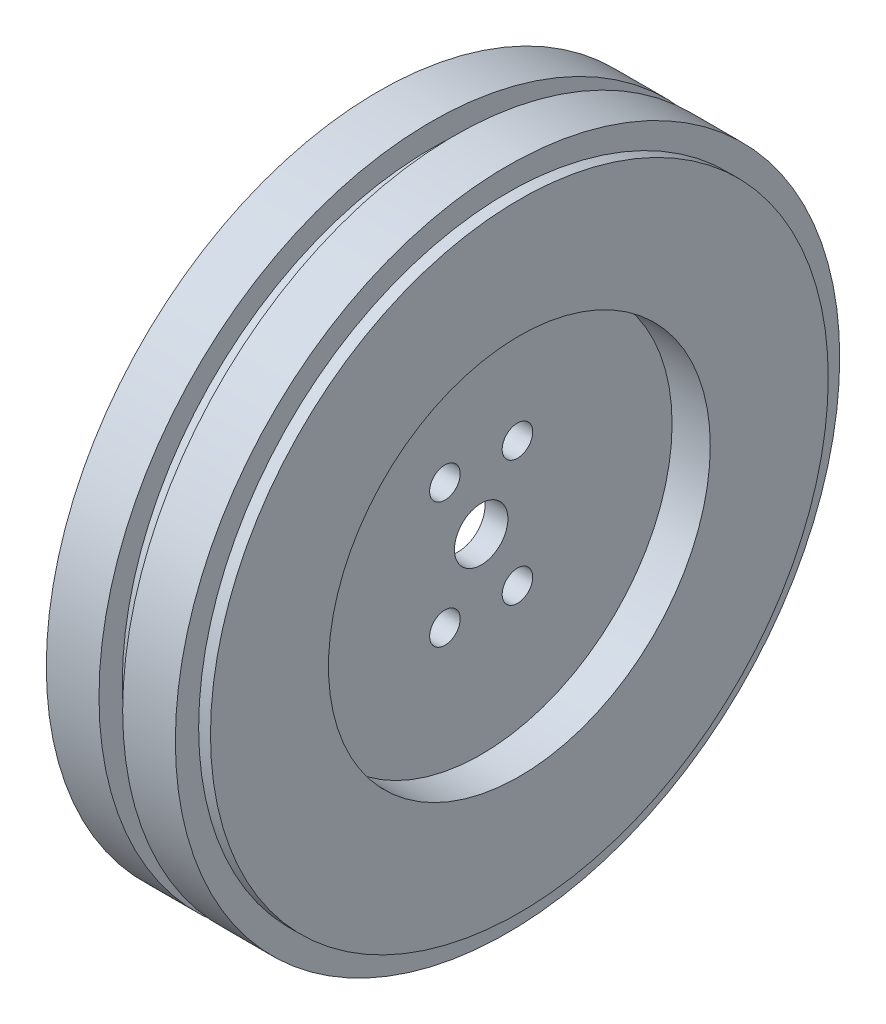
ISO-10303-21;
HEADER;
FILE_DESCRIPTION(('STEP AP214'),'2;1');
FILE_NAME('part.step','',(''),(''),'','','');
FILE_SCHEMA(('AUTOMOTIVE_DESIGN { 1 0 10303 214 1 1 1 1 }'));
ENDSEC;
DATA;
#1=APPLICATION_CONTEXT('core data for automotive mechanical design processes');
#2=APPLICATION_PROTOCOL_DEFINITION('international standard','automotive_design',2000,#1);
#3=PRODUCT_CONTEXT('',#1,'mechanical');
#4=PRODUCT('Part','Part','',(#3));
#5=PRODUCT_RELATED_PRODUCT_CATEGORY('part','',(#4));
#6=PRODUCT_DEFINITION_FORMATION('','',#4);
#7=PRODUCT_DEFINITION_CONTEXT('part definition',#1,'design');
#8=PRODUCT_DEFINITION('design','',#6,#7);
#9=PRODUCT_DEFINITION_SHAPE('','',#8);
#10=(LENGTH_UNIT() NAMED_UNIT(*) SI_UNIT(.MILLI.,.METRE.));
#11=(NAMED_UNIT(*) PLANE_ANGLE_UNIT() SI_UNIT($,.RADIAN.));
#12=(NAMED_UNIT(*) SI_UNIT($,.STERADIAN.) SOLID_ANGLE_UNIT());
#13=UNCERTAINTY_MEASURE_WITH_UNIT(LENGTH_MEASURE(1.E-05),#10,'distance_accuracy_value','');
#14=(GEOMETRIC_REPRESENTATION_CONTEXT(3) GLOBAL_UNCERTAINTY_ASSIGNED_CONTEXT((#13)) GLOBAL_UNIT_ASSIGNED_CONTEXT((#10,
#11,#12)) REPRESENTATION_CONTEXT('',''));
#15=CARTESIAN_POINT('',(0.,0.,0.));
#16=DIRECTION('',(0.,0.,1.));
#17=DIRECTION('',(1.,0.,0.));
#18=AXIS2_PLACEMENT_3D('',#15,#16,#17);
#19=CARTESIAN_POINT('',(8.00000000000001,0.,0.));
#20=DIRECTION('',(-1.,0.,0.));
#21=DIRECTION('',(0.,0.,1.));
#22=AXIS2_PLACEMENT_3D('',#19,#20,#21);
#23=CYLINDRICAL_SURFACE('',#22,43.5);
#24=CARTESIAN_POINT('',(-0.449999999999995,0.,0.));
#25=DIRECTION('',(-1.,0.,0.));
#26=DIRECTION('',(0.,0.,1.));
#27=AXIS2_PLACEMENT_3D('',#24,#25,#26);
#28=CIRCLE('',#27,43.5);
#29=CARTESIAN_POINT('',(-0.449999999999995,0.,43.5));
#30=VERTEX_POINT('',#29);
#31=EDGE_CURVE('E97',#30,#30,#28,.T.);
#32=ORIENTED_EDGE('',*,*,#31,.F.);
#33=EDGE_LOOP('',(#32));
#34=FACE_BOUND('',#33,.T.);
#35=CARTESIAN_POINT('',(6.45,0.,0.));
#36=DIRECTION('',(1.,0.,0.));
#37=DIRECTION('',(0.,0.,-1.));
#38=AXIS2_PLACEMENT_3D('',#35,#36,#37);
#39=CIRCLE('',#38,43.5);
#40=CARTESIAN_POINT('',(6.45,0.,-43.5));
#41=VERTEX_POINT('',#40);
#42=EDGE_CURVE('E103',#41,#41,#39,.T.);
#43=ORIENTED_EDGE('',*,*,#42,.F.);
#44=EDGE_LOOP('',(#43));
#45=FACE_BOUND('',#44,.T.);
#46=ADVANCED_FACE('F32',(#34,#45),#23,.T.);
#47=CARTESIAN_POINT('',(8.,40.,0.));
#48=DIRECTION('',(-1.,0.,0.));
#49=DIRECTION('',(0.,0.,1.));
#50=AXIS2_PLACEMENT_3D('',#47,#48,#49);
#51=PLANE('',#50);
#52=CARTESIAN_POINT('',(8.,0.,0.));
#53=DIRECTION('',(1.,0.,0.));
#54=DIRECTION('',(0.,0.,-1.));
#55=AXIS2_PLACEMENT_3D('',#52,#53,#54);
#56=CIRCLE('',#55,25.);
#57=CARTESIAN_POINT('',(8.,0.,-25.));
#58=VERTEX_POINT('',#57);
#59=EDGE_CURVE('E77',#58,#58,#56,.T.);
#60=ORIENTED_EDGE('',*,*,#59,.F.);
#61=EDGE_LOOP('',(#60));
#62=FACE_BOUND('',#61,.T.);
#63=CARTESIAN_POINT('',(8.,0.,0.));
#64=DIRECTION('',(1.,0.,0.));
#65=DIRECTION('',(0.,0.,-1.));
#66=AXIS2_PLACEMENT_3D('',#63,#64,#65);
#67=CIRCLE('',#66,40.45);
#68=CARTESIAN_POINT('',(8.,0.,-40.45));
#69=VERTEX_POINT('',#68);
#70=EDGE_CURVE('E107',#69,#69,#67,.T.);
#71=ORIENTED_EDGE('',*,*,#70,.T.);
#72=EDGE_LOOP('',(#71));
#73=FACE_BOUND('',#72,.T.);
#74=ADVANCED_FACE('F124',(#62,#73),#51,.F.);
#75=CARTESIAN_POINT('',(-12.,0.,0.));
#76=DIRECTION('',(-1.,0.,0.));
#77=DIRECTION('',(0.,0.,1.));
#78=AXIS2_PLACEMENT_3D('',#75,#76,#77);
#79=PLANE('',#78);
#80=CARTESIAN_POINT('',(-12.,0.,0.));
#81=DIRECTION('',(-1.,0.,0.));
#82=DIRECTION('',(0.,0.,1.));
#83=AXIS2_PLACEMENT_3D('',#80,#81,#82);
#84=CIRCLE('',#83,34.);
#85=CARTESIAN_POINT('',(-12.,0.,34.));
#86=VERTEX_POINT('',#85);
#87=EDGE_CURVE('E73',#86,#86,#84,.F.);
#88=ORIENTED_EDGE('',*,*,#87,.T.);
#89=EDGE_LOOP('',(#88));
#90=FACE_BOUND('',#89,.T.);
#91=CARTESIAN_POINT('',(-12.,0.,0.));
#92=DIRECTION('',(-1.,0.,0.));
#93=DIRECTION('',(0.,0.,1.));
#94=AXIS2_PLACEMENT_3D('',#91,#92,#93);
#95=CIRCLE('',#94,40.45);
#96=CARTESIAN_POINT('',(-12.,0.,40.45));
#97=VERTEX_POINT('',#96);
#98=EDGE_CURVE('E86',#97,#97,#95,.T.);
#99=ORIENTED_EDGE('',*,*,#98,.T.);
#100=EDGE_LOOP('',(#99));
#101=FACE_BOUND('',#100,.T.);
#102=ADVANCED_FACE('F131',(#90,#101),#79,.T.);
#103=CARTESIAN_POINT('',(-3.54999999999999,0.,0.));
#104=DIRECTION('',(-1.,0.,0.));
#105=DIRECTION('',(0.,0.,1.));
#106=AXIS2_PLACEMENT_3D('',#103,#104,#105);
#107=CIRCLE('',#106,43.5);
#108=CARTESIAN_POINT('',(-3.54999999999999,0.,43.5));
#109=VERTEX_POINT('',#108);
#110=EDGE_CURVE('E89',#109,#109,#107,.T.);
#111=ORIENTED_EDGE('',*,*,#110,.T.);
#112=EDGE_LOOP('',(#111));
#113=FACE_BOUND('',#112,.T.);
#114=CARTESIAN_POINT('',(-10.45,0.,0.));
#115=DIRECTION('',(-1.,0.,0.));
#116=DIRECTION('',(0.,0.,1.));
#117=AXIS2_PLACEMENT_3D('',#114,#115,#116);
#118=CIRCLE('',#117,43.5);
#119=CARTESIAN_POINT('',(-10.45,0.,43.5));
#120=VERTEX_POINT('',#119);
#121=EDGE_CURVE('E80',#120,#120,#118,.T.);
#122=ORIENTED_EDGE('',*,*,#121,.F.);
#123=EDGE_LOOP('',(#122));
#124=FACE_BOUND('',#123,.T.);
#125=ADVANCED_FACE('F127',(#113,#124),#23,.T.);
#126=CARTESIAN_POINT('',(-49.6444990272902,0.,0.));
#127=DIRECTION('',(-1.,0.,0.));
#128=DIRECTION('',(0.,0.,1.));
#129=AXIS2_PLACEMENT_3D('',#126,#127,#128);
#130=CYLINDRICAL_SURFACE('',#129,34.);
#131=CARTESIAN_POINT('',(0.,0.,0.));
#132=DIRECTION('',(-1.,0.,0.));
#133=DIRECTION('',(0.,0.,1.));
#134=AXIS2_PLACEMENT_3D('',#131,#132,#133);
#135=CIRCLE('',#134,34.);
#136=CARTESIAN_POINT('',(0.,0.,34.));
#137=VERTEX_POINT('',#136);
#138=EDGE_CURVE('E10',#137,#137,#135,.T.);
#139=ORIENTED_EDGE('',*,*,#138,.F.);
#140=EDGE_LOOP('',(#139));
#141=FACE_BOUND('',#140,.T.);
#142=ORIENTED_EDGE('',*,*,#87,.F.);
#143=EDGE_LOOP('',(#142));
#144=FACE_BOUND('',#143,.T.);
#145=ADVANCED_FACE('F34',(#141,#144),#130,.F.);
#146=CARTESIAN_POINT('',(0.,34.,0.));
#147=DIRECTION('',(1.,0.,0.));
#148=DIRECTION('',(0.,0.,-1.));
#149=AXIS2_PLACEMENT_3D('',#146,#147,#148);
#150=PLANE('',#149);
#151=CARTESIAN_POINT('',(0.,0.,0.));
#152=DIRECTION('',(1.,0.,0.));
#153=DIRECTION('',(0.,0.,-1.));
#154=AXIS2_PLACEMENT_3D('',#151,#152,#153);
#155=CIRCLE('',#154,3.5);
#156=CARTESIAN_POINT('',(0.,0.,-3.5));
#157=VERTEX_POINT('',#156);
#158=EDGE_CURVE('E67',#157,#157,#155,.T.);
#159=ORIENTED_EDGE('',*,*,#158,.T.);
#160=EDGE_LOOP('',(#159));
#161=FACE_BOUND('',#160,.T.);
#162=CARTESIAN_POINT('',(0.,8.22724133595216,4.75000000000001));
#163=DIRECTION('',(1.,0.,0.));
#164=DIRECTION('',(0.,0.,-1.));
#165=AXIS2_PLACEMENT_3D('',#162,#163,#164);
#166=CIRCLE('',#165,2.);
#167=CARTESIAN_POINT('',(0.,8.22724133595216,2.75000000000001));
#168=VERTEX_POINT('',#167);
#169=EDGE_CURVE('E39',#168,#168,#166,.T.);
#170=ORIENTED_EDGE('',*,*,#169,.T.);
#171=EDGE_LOOP('',(#170));
#172=FACE_BOUND('',#171,.T.);
#173=CARTESIAN_POINT('',(0.,-8.22724133595216,-4.75000000000001));
#174=DIRECTION('',(1.,0.,0.));
#175=DIRECTION('',(0.,0.,-1.));
#176=AXIS2_PLACEMENT_3D('',#173,#174,#175);
#177=CIRCLE('',#176,2.);
#178=CARTESIAN_POINT('',(0.,-8.22724133595216,-6.75000000000001));
#179=VERTEX_POINT('',#178);
#180=EDGE_CURVE('E43',#179,#179,#177,.T.);
#181=ORIENTED_EDGE('',*,*,#180,.T.);
#182=EDGE_LOOP('',(#181));
#183=FACE_BOUND('',#182,.T.);
#184=CARTESIAN_POINT('',(0.,-8.22724133595216,4.75000000000001));
#185=DIRECTION('',(1.,0.,0.));
#186=DIRECTION('',(0.,0.,-1.));
#187=AXIS2_PLACEMENT_3D('',#184,#185,#186);
#188=CIRCLE('',#187,2.);
#189=CARTESIAN_POINT('',(0.,-8.22724133595216,2.75000000000001));
#190=VERTEX_POINT('',#189);
#191=EDGE_CURVE('E47',#190,#190,#188,.T.);
#192=ORIENTED_EDGE('',*,*,#191,.T.);
#193=EDGE_LOOP('',(#192));
#194=FACE_BOUND('',#193,.T.);
#195=CARTESIAN_POINT('',(0.,8.22724133595216,-4.75000000000001));
#196=DIRECTION('',(1.,0.,0.));
#197=DIRECTION('',(0.,0.,-1.));
#198=AXIS2_PLACEMENT_3D('',#195,#196,#197);
#199=CIRCLE('',#198,2.);
#200=CARTESIAN_POINT('',(0.,8.22724133595216,-6.75000000000001));
#201=VERTEX_POINT('',#200);
#202=EDGE_CURVE('E52',#201,#201,#199,.T.);
#203=ORIENTED_EDGE('',*,*,#202,.T.);
#204=EDGE_LOOP('',(#203));
#205=FACE_BOUND('',#204,.T.);
#206=ORIENTED_EDGE('',*,*,#138,.T.);
#207=EDGE_LOOP('',(#206));
#208=FACE_BOUND('',#207,.T.);
#209=ADVANCED_FACE('F142',(#161,#172,#183,#194,#205,#208),#150,.F.);
#210=CARTESIAN_POINT('',(3.,12.5,0.));
#211=DIRECTION('',(1.,0.,0.));
#212=DIRECTION('',(0.,0.,-1.));
#213=AXIS2_PLACEMENT_3D('',#210,#211,#212);
#214=PLANE('',#213);
#215=CARTESIAN_POINT('',(3.,0.,0.));
#216=DIRECTION('',(1.,0.,0.));
#217=DIRECTION('',(0.,0.,-1.));
#218=AXIS2_PLACEMENT_3D('',#215,#216,#217);
#219=CIRCLE('',#218,3.5);
#220=CARTESIAN_POINT('',(3.,0.,-3.5));
#221=VERTEX_POINT('',#220);
#222=EDGE_CURVE('E70',#221,#221,#219,.T.);
#223=ORIENTED_EDGE('',*,*,#222,.F.);
#224=EDGE_LOOP('',(#223));
#225=FACE_BOUND('',#224,.T.);
#226=CARTESIAN_POINT('',(3.,8.22724133595216,4.75000000000001));
#227=DIRECTION('',(1.,0.,0.));
#228=DIRECTION('',(0.,0.,1.));
#229=AXIS2_PLACEMENT_3D('',#226,#227,#228);
#230=CIRCLE('',#229,2.);
#231=CARTESIAN_POINT('',(3.,8.22724133595216,6.75000000000001));
#232=VERTEX_POINT('',#231);
#233=EDGE_CURVE('E58',#232,#232,#230,.T.);
#234=ORIENTED_EDGE('',*,*,#233,.F.);
#235=EDGE_LOOP('',(#234));
#236=FACE_BOUND('',#235,.T.);
#237=CARTESIAN_POINT('',(3.,-8.22724133595216,-4.75000000000001));
#238=DIRECTION('',(1.,0.,0.));
#239=DIRECTION('',(0.,0.,1.));
#240=AXIS2_PLACEMENT_3D('',#237,#238,#239);
#241=CIRCLE('',#240,2.);
#242=CARTESIAN_POINT('',(3.,-8.22724133595216,-2.75000000000001));
#243=VERTEX_POINT('',#242);
#244=EDGE_CURVE('E59',#243,#243,#241,.T.);
#245=ORIENTED_EDGE('',*,*,#244,.F.);
#246=EDGE_LOOP('',(#245));
#247=FACE_BOUND('',#246,.T.);
#248=CARTESIAN_POINT('',(3.,-8.22724133595216,4.75000000000001));
#249=DIRECTION('',(1.,0.,0.));
#250=DIRECTION('',(0.,0.,-1.));
#251=AXIS2_PLACEMENT_3D('',#248,#249,#250);
#252=CIRCLE('',#251,2.);
#253=CARTESIAN_POINT('',(3.,-8.22724133595216,2.75000000000001));
#254=VERTEX_POINT('',#253);
#255=EDGE_CURVE('E62',#254,#254,#252,.T.);
#256=ORIENTED_EDGE('',*,*,#255,.F.);
#257=EDGE_LOOP('',(#256));
#258=FACE_BOUND('',#257,.T.);
#259=CARTESIAN_POINT('',(3.,8.22724133595216,-4.75000000000001));
#260=DIRECTION('',(1.,0.,0.));
#261=DIRECTION('',(0.,0.,-1.));
#262=AXIS2_PLACEMENT_3D('',#259,#260,#261);
#263=CIRCLE('',#262,2.);
#264=CARTESIAN_POINT('',(3.,8.22724133595216,-6.75000000000001));
#265=VERTEX_POINT('',#264);
#266=EDGE_CURVE('E55',#265,#265,#263,.T.);
#267=ORIENTED_EDGE('',*,*,#266,.F.);
#268=EDGE_LOOP('',(#267));
#269=FACE_BOUND('',#268,.T.);
#270=CARTESIAN_POINT('',(3.,0.,0.));
#271=DIRECTION('',(1.,0.,0.));
#272=DIRECTION('',(0.,0.,-1.));
#273=AXIS2_PLACEMENT_3D('',#270,#271,#272);
#274=CIRCLE('',#273,25.);
#275=CARTESIAN_POINT('',(3.,0.,-25.));
#276=VERTEX_POINT('',#275);
#277=EDGE_CURVE('E76',#276,#276,#274,.T.);
#278=ORIENTED_EDGE('',*,*,#277,.T.);
#279=EDGE_LOOP('',(#278));
#280=FACE_BOUND('',#279,.T.);
#281=ADVANCED_FACE('F233',(#225,#236,#247,#258,#269,#280),#214,.T.);
#282=CARTESIAN_POINT('',(-32.,8.22724133595216,-4.75000000000001));
#283=DIRECTION('',(1.,0.,0.));
#284=DIRECTION('',(0.,0.,-1.));
#285=AXIS2_PLACEMENT_3D('',#282,#283,#284);
#286=CYLINDRICAL_SURFACE('',#285,2.);
#287=ORIENTED_EDGE('',*,*,#266,.T.);
#288=EDGE_LOOP('',(#287));
#289=FACE_BOUND('',#288,.T.);
#290=ORIENTED_EDGE('',*,*,#202,.F.);
#291=EDGE_LOOP('',(#290));
#292=FACE_BOUND('',#291,.T.);
#293=ADVANCED_FACE('F237',(#289,#292),#286,.F.);
#294=CARTESIAN_POINT('',(-32.,-8.22724133595216,4.75000000000001));
#295=DIRECTION('',(1.,0.,0.));
#296=DIRECTION('',(0.,0.,-1.));
#297=AXIS2_PLACEMENT_3D('',#294,#295,#296);
#298=CYLINDRICAL_SURFACE('',#297,2.);
#299=ORIENTED_EDGE('',*,*,#255,.T.);
#300=EDGE_LOOP('',(#299));
#301=FACE_BOUND('',#300,.T.);
#302=ORIENTED_EDGE('',*,*,#191,.F.);
#303=EDGE_LOOP('',(#302));
#304=FACE_BOUND('',#303,.T.);
#305=ADVANCED_FACE('F283',(#301,#304),#298,.F.);
#306=CARTESIAN_POINT('',(-32.,-8.22724133595216,-4.75000000000001));
#307=DIRECTION('',(1.,0.,0.));
#308=DIRECTION('',(0.,0.,-1.));
#309=AXIS2_PLACEMENT_3D('',#306,#307,#308);
#310=CYLINDRICAL_SURFACE('',#309,2.);
#311=ORIENTED_EDGE('',*,*,#244,.T.);
#312=EDGE_LOOP('',(#311));
#313=FACE_BOUND('',#312,.T.);
#314=ORIENTED_EDGE('',*,*,#180,.F.);
#315=EDGE_LOOP('',(#314));
#316=FACE_BOUND('',#315,.T.);
#317=ADVANCED_FACE('F273',(#313,#316),#310,.F.);
#318=CARTESIAN_POINT('',(-32.,8.22724133595216,4.75000000000001));
#319=DIRECTION('',(1.,0.,0.));
#320=DIRECTION('',(0.,0.,-1.));
#321=AXIS2_PLACEMENT_3D('',#318,#319,#320);
#322=CYLINDRICAL_SURFACE('',#321,2.);
#323=ORIENTED_EDGE('',*,*,#233,.T.);
#324=EDGE_LOOP('',(#323));
#325=FACE_BOUND('',#324,.T.);
#326=ORIENTED_EDGE('',*,*,#169,.F.);
#327=EDGE_LOOP('',(#326));
#328=FACE_BOUND('',#327,.T.);
#329=ADVANCED_FACE('F255',(#325,#328),#322,.F.);
#330=CARTESIAN_POINT('',(-32.,0.,0.));
#331=DIRECTION('',(1.,0.,0.));
#332=DIRECTION('',(0.,0.,-1.));
#333=AXIS2_PLACEMENT_3D('',#330,#331,#332);
#334=CYLINDRICAL_SURFACE('',#333,3.5);
#335=ORIENTED_EDGE('',*,*,#222,.T.);
#336=EDGE_LOOP('',(#335));
#337=FACE_BOUND('',#336,.T.);
#338=ORIENTED_EDGE('',*,*,#158,.F.);
#339=EDGE_LOOP('',(#338));
#340=FACE_BOUND('',#339,.T.);
#341=ADVANCED_FACE('F162',(#337,#340),#334,.F.);
#342=CARTESIAN_POINT('',(3.,0.,0.));
#343=DIRECTION('',(1.,0.,0.));
#344=DIRECTION('',(0.,0.,-1.));
#345=AXIS2_PLACEMENT_3D('',#342,#343,#344);
#346=CYLINDRICAL_SURFACE('',#345,25.);
#347=ORIENTED_EDGE('',*,*,#277,.F.);
#348=EDGE_LOOP('',(#347));
#349=FACE_BOUND('',#348,.T.);
#350=ORIENTED_EDGE('',*,*,#59,.T.);
#351=EDGE_LOOP('',(#350));
#352=FACE_BOUND('',#351,.T.);
#353=ADVANCED_FACE('F153',(#349,#352),#346,.F.);
#354=CARTESIAN_POINT('',(-10.45,0.,0.));
#355=DIRECTION('',(-1.,0.,0.));
#356=DIRECTION('',(0.,0.,1.));
#357=AXIS2_PLACEMENT_3D('',#354,#355,#356);
#358=PLANE('',#357);
#359=CARTESIAN_POINT('',(-10.45,0.,0.));
#360=DIRECTION('',(-1.,0.,0.));
#361=DIRECTION('',(0.,0.,1.));
#362=AXIS2_PLACEMENT_3D('',#359,#360,#361);
#363=CIRCLE('',#362,40.45);
#364=CARTESIAN_POINT('',(-10.45,0.,40.45));
#365=VERTEX_POINT('',#364);
#366=EDGE_CURVE('E85',#365,#365,#363,.T.);
#367=ORIENTED_EDGE('',*,*,#366,.F.);
#368=EDGE_LOOP('',(#367));
#369=FACE_BOUND('',#368,.T.);
#370=ORIENTED_EDGE('',*,*,#121,.T.);
#371=EDGE_LOOP('',(#370));
#372=FACE_BOUND('',#371,.T.);
#373=ADVANCED_FACE('F150',(#369,#372),#358,.T.);
#374=CARTESIAN_POINT('',(-10.45,0.,0.));
#375=DIRECTION('',(-1.,0.,0.));
#376=DIRECTION('',(0.,0.,1.));
#377=AXIS2_PLACEMENT_3D('',#374,#375,#376);
#378=CYLINDRICAL_SURFACE('',#377,40.45);
#379=ORIENTED_EDGE('',*,*,#366,.T.);
#380=EDGE_LOOP('',(#379));
#381=FACE_BOUND('',#380,.T.);
#382=ORIENTED_EDGE('',*,*,#98,.F.);
#383=EDGE_LOOP('',(#382));
#384=FACE_BOUND('',#383,.T.);
#385=ADVANCED_FACE('F152',(#381,#384),#378,.T.);
#386=CARTESIAN_POINT('',(-3.54999999999999,0.,0.));
#387=DIRECTION('',(-1.,0.,0.));
#388=DIRECTION('',(0.,0.,1.));
#389=AXIS2_PLACEMENT_3D('',#386,#387,#388);
#390=PLANE('',#389);
#391=ORIENTED_EDGE('',*,*,#110,.F.);
#392=EDGE_LOOP('',(#391));
#393=FACE_BOUND('',#392,.T.);
#394=CARTESIAN_POINT('',(-3.54999999999999,0.,0.));
#395=DIRECTION('',(-1.,0.,0.));
#396=DIRECTION('',(0.,0.,1.));
#397=AXIS2_PLACEMENT_3D('',#394,#395,#396);
#398=CIRCLE('',#397,40.45);
#399=CARTESIAN_POINT('',(-3.54999999999999,0.,40.45));
#400=VERTEX_POINT('',#399);
#401=EDGE_CURVE('E94',#400,#400,#398,.T.);
#402=ORIENTED_EDGE('',*,*,#401,.T.);
#403=EDGE_LOOP('',(#402));
#404=FACE_BOUND('',#403,.T.);
#405=ADVANCED_FACE('F159',(#393,#404),#390,.F.);
#406=CARTESIAN_POINT('',(-3.54999999999999,0.,0.));
#407=DIRECTION('',(1.,0.,0.));
#408=DIRECTION('',(0.,0.,-1.));
#409=AXIS2_PLACEMENT_3D('',#406,#407,#408);
#410=CYLINDRICAL_SURFACE('',#409,40.45);
#411=ORIENTED_EDGE('',*,*,#401,.F.);
#412=EDGE_LOOP('',(#411));
#413=FACE_BOUND('',#412,.T.);
#414=CARTESIAN_POINT('',(-0.449999999999995,0.,0.));
#415=DIRECTION('',(-1.,0.,0.));
#416=DIRECTION('',(0.,0.,1.));
#417=AXIS2_PLACEMENT_3D('',#414,#415,#416);
#418=CIRCLE('',#417,40.45);
#419=CARTESIAN_POINT('',(-0.449999999999995,0.,40.45));
#420=VERTEX_POINT('',#419);
#421=EDGE_CURVE('E100',#420,#420,#418,.T.);
#422=ORIENTED_EDGE('',*,*,#421,.T.);
#423=EDGE_LOOP('',(#422));
#424=FACE_BOUND('',#423,.T.);
#425=ADVANCED_FACE('F168',(#413,#424),#410,.T.);
#426=CARTESIAN_POINT('',(-0.449999999999995,0.,0.));
#427=DIRECTION('',(-1.,0.,0.));
#428=DIRECTION('',(0.,0.,1.));
#429=AXIS2_PLACEMENT_3D('',#426,#427,#428);
#430=PLANE('',#429);
#431=ORIENTED_EDGE('',*,*,#421,.F.);
#432=EDGE_LOOP('',(#431));
#433=FACE_BOUND('',#432,.T.);
#434=ORIENTED_EDGE('',*,*,#31,.T.);
#435=EDGE_LOOP('',(#434));
#436=FACE_BOUND('',#435,.T.);
#437=ADVANCED_FACE('F119',(#433,#436),#430,.T.);
#438=CARTESIAN_POINT('',(6.45,0.,0.));
#439=DIRECTION('',(1.,0.,0.));
#440=DIRECTION('',(0.,0.,-1.));
#441=AXIS2_PLACEMENT_3D('',#438,#439,#440);
#442=PLANE('',#441);
#443=CARTESIAN_POINT('',(6.45,0.,0.));
#444=DIRECTION('',(1.,0.,0.));
#445=DIRECTION('',(0.,0.,-1.));
#446=AXIS2_PLACEMENT_3D('',#443,#444,#445);
#447=CIRCLE('',#446,40.45);
#448=CARTESIAN_POINT('',(6.45,0.,-40.45));
#449=VERTEX_POINT('',#448);
#450=EDGE_CURVE('E106',#449,#449,#447,.T.);
#451=ORIENTED_EDGE('',*,*,#450,.F.);
#452=EDGE_LOOP('',(#451));
#453=FACE_BOUND('',#452,.T.);
#454=ORIENTED_EDGE('',*,*,#42,.T.);
#455=EDGE_LOOP('',(#454));
#456=FACE_BOUND('',#455,.T.);
#457=ADVANCED_FACE('F116',(#453,#456),#442,.T.);
#458=CARTESIAN_POINT('',(6.45,0.,0.));
#459=DIRECTION('',(1.,0.,0.));
#460=DIRECTION('',(0.,0.,-1.));
#461=AXIS2_PLACEMENT_3D('',#458,#459,#460);
#462=CYLINDRICAL_SURFACE('',#461,40.45);
#463=ORIENTED_EDGE('',*,*,#450,.T.);
#464=EDGE_LOOP('',(#463));
#465=FACE_BOUND('',#464,.T.);
#466=ORIENTED_EDGE('',*,*,#70,.F.);
#467=EDGE_LOOP('',(#466));
#468=FACE_BOUND('',#467,.T.);
#469=ADVANCED_FACE('F113',(#465,#468),#462,.T.);
#470=CLOSED_SHELL('',(#46,#74,#102,#125,#145,#209,#281,#293,#305,#317,#329,#341,#353,#373,#385,
#405,#425,#437,#457,#469));
#471=MANIFOLD_SOLID_BREP('B2',#470);
#472=ADVANCED_BREP_SHAPE_REPRESENTATION('',(#18,#471),#14);
#473=SHAPE_DEFINITION_REPRESENTATION(#9,#472);
ENDSEC;
END-ISO-10303-21;
